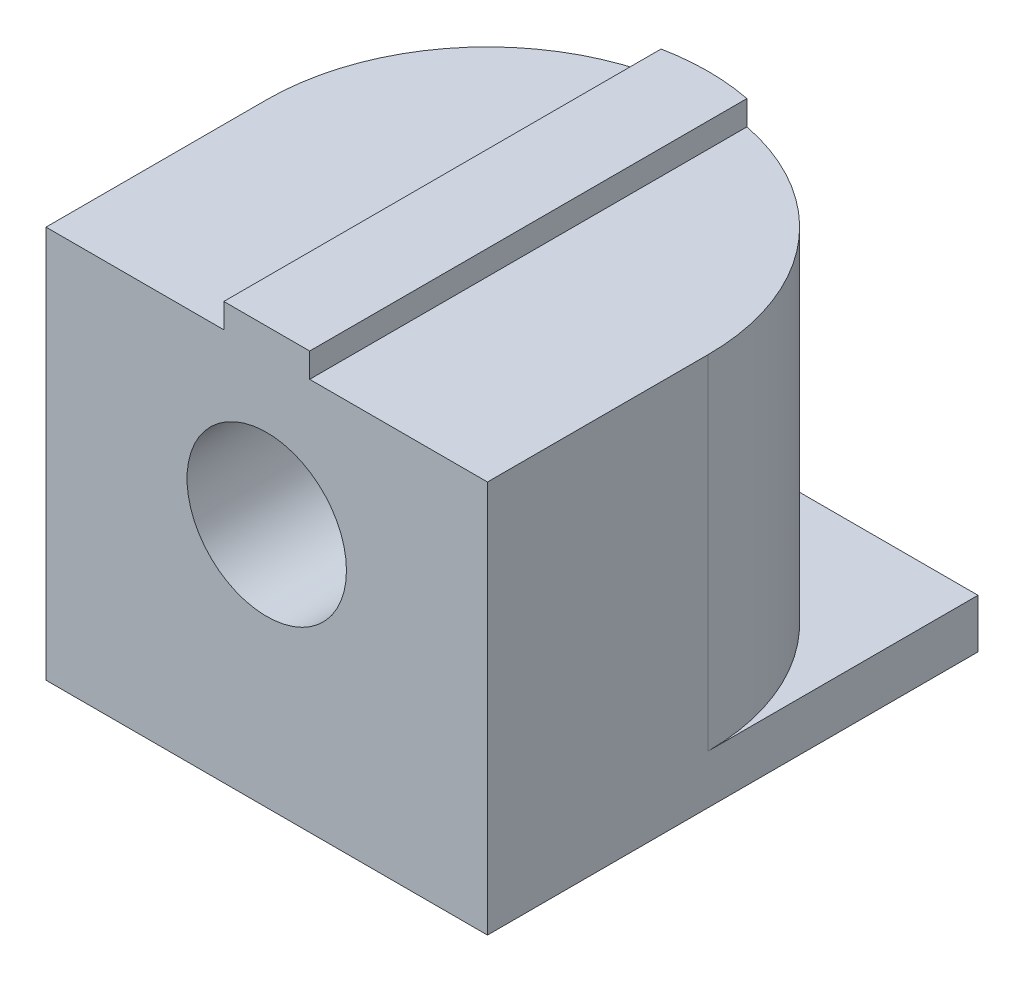
ISO-10303-21;
HEADER;
FILE_DESCRIPTION(('STEP AP214'),'2;1');
FILE_NAME('part.step','',(''),(''),'','','');
FILE_SCHEMA(('AUTOMOTIVE_DESIGN { 1 0 10303 214 1 1 1 1 }'));
ENDSEC;
DATA;
#1=APPLICATION_CONTEXT('core data for automotive mechanical design processes');
#2=APPLICATION_PROTOCOL_DEFINITION('international standard','automotive_design',2000,#1);
#3=PRODUCT_CONTEXT('',#1,'mechanical');
#4=PRODUCT('Part','Part','',(#3));
#5=PRODUCT_RELATED_PRODUCT_CATEGORY('part','',(#4));
#6=PRODUCT_DEFINITION_FORMATION('','',#4);
#7=PRODUCT_DEFINITION_CONTEXT('part definition',#1,'design');
#8=PRODUCT_DEFINITION('design','',#6,#7);
#9=PRODUCT_DEFINITION_SHAPE('','',#8);
#10=(LENGTH_UNIT() NAMED_UNIT(*) SI_UNIT(.MILLI.,.METRE.));
#11=(NAMED_UNIT(*) PLANE_ANGLE_UNIT() SI_UNIT($,.RADIAN.));
#12=(NAMED_UNIT(*) SI_UNIT($,.STERADIAN.) SOLID_ANGLE_UNIT());
#13=UNCERTAINTY_MEASURE_WITH_UNIT(LENGTH_MEASURE(1.E-05),#10,'distance_accuracy_value','');
#14=(GEOMETRIC_REPRESENTATION_CONTEXT(3) GLOBAL_UNCERTAINTY_ASSIGNED_CONTEXT((#13)) GLOBAL_UNIT_ASSIGNED_CONTEXT((#10,
#11,#12)) REPRESENTATION_CONTEXT('',''));
#15=CARTESIAN_POINT('',(0.,0.,0.));
#16=DIRECTION('',(0.,0.,1.));
#17=DIRECTION('',(1.,0.,0.));
#18=AXIS2_PLACEMENT_3D('',#15,#16,#17);
#19=CARTESIAN_POINT('',(0.,8.,0.));
#20=DIRECTION('',(0.,-1.,0.));
#21=DIRECTION('',(0.,0.,-1.));
#22=AXIS2_PLACEMENT_3D('',#19,#20,#21);
#23=PLANE('',#22);
#24=DIRECTION('',(0.,0.,-1.));
#25=VECTOR('',#24,1.);
#26=CARTESIAN_POINT('',(0.874999999999999,8.,-3.91411089575239));
#27=LINE('',#26,#25);
#28=CARTESIAN_POINT('',(0.875,8.,5.));
#29=VERTEX_POINT('',#28);
#30=CARTESIAN_POINT('',(0.874999999999999,8.,-3.91411089575239));
#31=VERTEX_POINT('',#30);
#32=EDGE_CURVE('E50',#29,#31,#27,.T.);
#33=ORIENTED_EDGE('',*,*,#32,.F.);
#34=DIRECTION('',(1.,0.,0.));
#35=VECTOR('',#34,1.);
#36=CARTESIAN_POINT('',(-4.5,8.,5.));
#37=LINE('',#36,#35);
#38=CARTESIAN_POINT('',(4.5,8.,5.));
#39=VERTEX_POINT('',#38);
#40=EDGE_CURVE('E156',#29,#39,#37,.T.);
#41=ORIENTED_EDGE('',*,*,#40,.T.);
#42=DIRECTION('',(0.,0.,-1.));
#43=VECTOR('',#42,1.);
#44=CARTESIAN_POINT('',(4.5,8.,5.));
#45=LINE('',#44,#43);
#46=CARTESIAN_POINT('',(4.5,8.,0.5));
#47=VERTEX_POINT('',#46);
#48=EDGE_CURVE('E159',#39,#47,#45,.T.);
#49=ORIENTED_EDGE('',*,*,#48,.T.);
#50=CARTESIAN_POINT('',(0.,8.,0.5));
#51=DIRECTION('',(0.,-1.,0.));
#52=DIRECTION('',(0.,0.,-1.));
#53=AXIS2_PLACEMENT_3D('',#50,#51,#52);
#54=CIRCLE('',#53,4.5);
#55=EDGE_CURVE('E192',#47,#31,#54,.F.);
#56=ORIENTED_EDGE('',*,*,#55,.T.);
#57=EDGE_LOOP('',(#33,#41,#49,#56));
#58=FACE_BOUND('',#57,.T.);
#59=ADVANCED_FACE('F34',(#58),#23,.F.);
#60=DIRECTION('',(0.,0.,1.));
#61=VECTOR('',#60,1.);
#62=CARTESIAN_POINT('',(-0.875,8.,-3.91411089575239));
#63=LINE('',#62,#61);
#64=CARTESIAN_POINT('',(-0.875,8.,-3.91411089575239));
#65=VERTEX_POINT('',#64);
#66=CARTESIAN_POINT('',(-0.874999999999999,8.,5.));
#67=VERTEX_POINT('',#66);
#68=EDGE_CURVE('E58',#65,#67,#63,.T.);
#69=ORIENTED_EDGE('',*,*,#68,.F.);
#70=CARTESIAN_POINT('',(0.,8.,0.5));
#71=DIRECTION('',(0.,-1.,0.));
#72=DIRECTION('',(0.,0.,-1.));
#73=AXIS2_PLACEMENT_3D('',#70,#71,#72);
#74=CIRCLE('',#73,4.5);
#75=CARTESIAN_POINT('',(-4.5,8.,0.5));
#76=VERTEX_POINT('',#75);
#77=EDGE_CURVE('E132',#65,#76,#74,.F.);
#78=ORIENTED_EDGE('',*,*,#77,.T.);
#79=DIRECTION('',(0.,0.,1.));
#80=VECTOR('',#79,1.);
#81=CARTESIAN_POINT('',(-4.5,8.,5.));
#82=LINE('',#81,#80);
#83=CARTESIAN_POINT('',(-4.5,8.,5.));
#84=VERTEX_POINT('',#83);
#85=EDGE_CURVE('E154',#76,#84,#82,.T.);
#86=ORIENTED_EDGE('',*,*,#85,.T.);
#87=EDGE_CURVE('E157',#84,#67,#37,.T.);
#88=ORIENTED_EDGE('',*,*,#87,.T.);
#89=EDGE_LOOP('',(#69,#78,#86,#88));
#90=FACE_BOUND('',#89,.T.);
#91=ADVANCED_FACE('F227',(#90),#23,.F.);
#92=CARTESIAN_POINT('',(0.,1.,0.));
#93=DIRECTION('',(0.,-1.,0.));
#94=DIRECTION('',(0.,0.,-1.));
#95=AXIS2_PLACEMENT_3D('',#92,#93,#94);
#96=PLANE('',#95);
#97=CARTESIAN_POINT('',(0.,1.,0.5));
#98=DIRECTION('',(0.,-1.,0.));
#99=DIRECTION('',(0.,0.,-1.));
#100=AXIS2_PLACEMENT_3D('',#97,#98,#99);
#101=CIRCLE('',#100,4.5);
#102=CARTESIAN_POINT('',(-4.5,1.,0.5));
#103=VERTEX_POINT('',#102);
#104=CARTESIAN_POINT('',(0.,1.,-4.));
#105=VERTEX_POINT('',#104);
#106=EDGE_CURVE('E43',#103,#105,#101,.T.);
#107=ORIENTED_EDGE('',*,*,#106,.T.);
#108=CARTESIAN_POINT('',(0.,1.,0.5));
#109=DIRECTION('',(0.,-1.,0.));
#110=DIRECTION('',(0.,0.,-1.));
#111=AXIS2_PLACEMENT_3D('',#108,#109,#110);
#112=CIRCLE('',#111,4.5);
#113=CARTESIAN_POINT('',(4.5,1.,0.5));
#114=VERTEX_POINT('',#113);
#115=EDGE_CURVE('E11',#105,#114,#112,.T.);
#116=ORIENTED_EDGE('',*,*,#115,.T.);
#117=DIRECTION('',(0.,0.,-1.));
#118=VECTOR('',#117,1.);
#119=CARTESIAN_POINT('',(4.5,1.,5.));
#120=LINE('',#119,#118);
#121=CARTESIAN_POINT('',(4.5,1.,-5.));
#122=VERTEX_POINT('',#121);
#123=EDGE_CURVE('E165',#114,#122,#120,.T.);
#124=ORIENTED_EDGE('',*,*,#123,.T.);
#125=DIRECTION('',(-1.,0.,0.));
#126=VECTOR('',#125,1.);
#127=CARTESIAN_POINT('',(-4.5,1.,-5.));
#128=LINE('',#127,#126);
#129=CARTESIAN_POINT('',(-4.5,1.,-5.));
#130=VERTEX_POINT('',#129);
#131=EDGE_CURVE('E168',#122,#130,#128,.T.);
#132=ORIENTED_EDGE('',*,*,#131,.T.);
#133=DIRECTION('',(0.,0.,1.));
#134=VECTOR('',#133,1.);
#135=CARTESIAN_POINT('',(-4.5,1.,5.));
#136=LINE('',#135,#134);
#137=EDGE_CURVE('E163',#130,#103,#136,.T.);
#138=ORIENTED_EDGE('',*,*,#137,.T.);
#139=EDGE_LOOP('',(#107,#116,#124,#132,#138));
#140=FACE_BOUND('',#139,.T.);
#141=ADVANCED_FACE('F200',(#140),#96,.F.);
#142=CARTESIAN_POINT('',(-4.5,1.,5.));
#143=DIRECTION('',(1.,0.,0.));
#144=DIRECTION('',(0.,0.,-1.));
#145=AXIS2_PLACEMENT_3D('',#142,#143,#144);
#146=PLANE('',#145);
#147=ORIENTED_EDGE('',*,*,#85,.F.);
#148=DIRECTION('',(0.,-1.,0.));
#149=VECTOR('',#148,1.);
#150=CARTESIAN_POINT('',(-4.5,1.,0.5));
#151=LINE('',#150,#149);
#152=EDGE_CURVE('E189',#76,#103,#151,.T.);
#153=ORIENTED_EDGE('',*,*,#152,.T.);
#154=ORIENTED_EDGE('',*,*,#137,.F.);
#155=DIRECTION('',(0.,-1.,0.));
#156=VECTOR('',#155,1.);
#157=CARTESIAN_POINT('',(-4.5,1.,-5.));
#158=LINE('',#157,#156);
#159=CARTESIAN_POINT('',(-4.5,0.,-5.));
#160=VERTEX_POINT('',#159);
#161=EDGE_CURVE('E170',#130,#160,#158,.T.);
#162=ORIENTED_EDGE('',*,*,#161,.T.);
#163=DIRECTION('',(0.,0.,1.));
#164=VECTOR('',#163,1.);
#165=CARTESIAN_POINT('',(-4.5,0.,5.));
#166=LINE('',#165,#164);
#167=CARTESIAN_POINT('',(-4.5,0.,5.));
#168=VERTEX_POINT('',#167);
#169=EDGE_CURVE('E162',#160,#168,#166,.T.);
#170=ORIENTED_EDGE('',*,*,#169,.T.);
#171=DIRECTION('',(0.,-1.,0.));
#172=VECTOR('',#171,1.);
#173=CARTESIAN_POINT('',(-4.5,1.,5.));
#174=LINE('',#173,#172);
#175=EDGE_CURVE('E186',#84,#168,#174,.T.);
#176=ORIENTED_EDGE('',*,*,#175,.F.);
#177=EDGE_LOOP('',(#147,#153,#154,#162,#170,#176));
#178=FACE_BOUND('',#177,.T.);
#179=ADVANCED_FACE('F224',(#178),#146,.F.);
#180=CARTESIAN_POINT('',(-4.5,1.,5.));
#181=DIRECTION('',(0.,0.,-1.));
#182=DIRECTION('',(-1.,0.,0.));
#183=AXIS2_PLACEMENT_3D('',#180,#181,#182);
#184=PLANE('',#183);
#185=CARTESIAN_POINT('',(0.,5.,5.));
#186=DIRECTION('',(0.,0.,1.));
#187=DIRECTION('',(1.,0.,0.));
#188=AXIS2_PLACEMENT_3D('',#185,#186,#187);
#189=CIRCLE('',#188,1.625);
#190=CARTESIAN_POINT('',(1.625,5.,5.));
#191=VERTEX_POINT('',#190);
#192=EDGE_CURVE('E321',#191,#191,#189,.T.);
#193=ORIENTED_EDGE('',*,*,#192,.F.);
#194=EDGE_LOOP('',(#193));
#195=FACE_BOUND('',#194,.T.);
#196=DIRECTION('',(1.,0.,0.));
#197=VECTOR('',#196,1.);
#198=CARTESIAN_POINT('',(-4.5,0.,5.));
#199=LINE('',#198,#197);
#200=CARTESIAN_POINT('',(4.5,0.,5.));
#201=VERTEX_POINT('',#200);
#202=EDGE_CURVE('E173',#168,#201,#199,.T.);
#203=ORIENTED_EDGE('',*,*,#202,.T.);
#204=DIRECTION('',(0.,-1.,0.));
#205=VECTOR('',#204,1.);
#206=CARTESIAN_POINT('',(4.5,1.,5.));
#207=LINE('',#206,#205);
#208=EDGE_CURVE('E183',#39,#201,#207,.T.);
#209=ORIENTED_EDGE('',*,*,#208,.F.);
#210=ORIENTED_EDGE('',*,*,#40,.F.);
#211=DIRECTION('',(0.,-1.,0.));
#212=VECTOR('',#211,1.);
#213=CARTESIAN_POINT('',(0.875000000000001,8.5,5.));
#214=LINE('',#213,#212);
#215=CARTESIAN_POINT('',(0.875000000000001,8.5,5.));
#216=VERTEX_POINT('',#215);
#217=EDGE_CURVE('E150',#216,#29,#214,.T.);
#218=ORIENTED_EDGE('',*,*,#217,.F.);
#219=DIRECTION('',(1.,0.,0.));
#220=VECTOR('',#219,1.);
#221=CARTESIAN_POINT('',(-0.874999999999999,8.5,5.));
#222=LINE('',#221,#220);
#223=CARTESIAN_POINT('',(-0.874999999999999,8.5,5.));
#224=VERTEX_POINT('',#223);
#225=EDGE_CURVE('E139',#224,#216,#222,.T.);
#226=ORIENTED_EDGE('',*,*,#225,.F.);
#227=DIRECTION('',(0.,-1.,0.));
#228=VECTOR('',#227,1.);
#229=CARTESIAN_POINT('',(-0.874999999999999,8.5,5.));
#230=LINE('',#229,#228);
#231=EDGE_CURVE('E134',#224,#67,#230,.T.);
#232=ORIENTED_EDGE('',*,*,#231,.T.);
#233=ORIENTED_EDGE('',*,*,#87,.F.);
#234=ORIENTED_EDGE('',*,*,#175,.T.);
#235=EDGE_LOOP('',(#203,#209,#210,#218,#226,#232,#233,#234));
#236=FACE_BOUND('',#235,.T.);
#237=ADVANCED_FACE('F212',(#195,#236),#184,.F.);
#238=CARTESIAN_POINT('',(4.5,1.,5.));
#239=DIRECTION('',(-1.,0.,0.));
#240=DIRECTION('',(0.,0.,1.));
#241=AXIS2_PLACEMENT_3D('',#238,#239,#240);
#242=PLANE('',#241);
#243=ORIENTED_EDGE('',*,*,#123,.F.);
#244=DIRECTION('',(0.,-1.,0.));
#245=VECTOR('',#244,1.);
#246=CARTESIAN_POINT('',(4.5,1.,0.5));
#247=LINE('',#246,#245);
#248=EDGE_CURVE('E195',#114,#47,#247,.F.);
#249=ORIENTED_EDGE('',*,*,#248,.T.);
#250=ORIENTED_EDGE('',*,*,#48,.F.);
#251=ORIENTED_EDGE('',*,*,#208,.T.);
#252=DIRECTION('',(0.,0.,-1.));
#253=VECTOR('',#252,1.);
#254=CARTESIAN_POINT('',(4.5,0.,5.));
#255=LINE('',#254,#253);
#256=CARTESIAN_POINT('',(4.5,0.,-5.));
#257=VERTEX_POINT('',#256);
#258=EDGE_CURVE('E175',#201,#257,#255,.T.);
#259=ORIENTED_EDGE('',*,*,#258,.T.);
#260=DIRECTION('',(0.,-1.,0.));
#261=VECTOR('',#260,1.);
#262=CARTESIAN_POINT('',(4.5,1.,-5.));
#263=LINE('',#262,#261);
#264=EDGE_CURVE('E180',#122,#257,#263,.T.);
#265=ORIENTED_EDGE('',*,*,#264,.F.);
#266=EDGE_LOOP('',(#243,#249,#250,#251,#259,#265));
#267=FACE_BOUND('',#266,.T.);
#268=ADVANCED_FACE('F207',(#267),#242,.F.);
#269=CARTESIAN_POINT('',(-4.5,1.,-5.));
#270=DIRECTION('',(0.,0.,1.));
#271=DIRECTION('',(1.,0.,0.));
#272=AXIS2_PLACEMENT_3D('',#269,#270,#271);
#273=PLANE('',#272);
#274=DIRECTION('',(-1.,0.,0.));
#275=VECTOR('',#274,1.);
#276=CARTESIAN_POINT('',(-4.5,0.,-5.));
#277=LINE('',#276,#275);
#278=EDGE_CURVE('E166',#257,#160,#277,.T.);
#279=ORIENTED_EDGE('',*,*,#278,.T.);
#280=ORIENTED_EDGE('',*,*,#161,.F.);
#281=ORIENTED_EDGE('',*,*,#131,.F.);
#282=ORIENTED_EDGE('',*,*,#264,.T.);
#283=EDGE_LOOP('',(#279,#280,#281,#282));
#284=FACE_BOUND('',#283,.T.);
#285=ADVANCED_FACE('F220',(#284),#273,.F.);
#286=CARTESIAN_POINT('',(0.,0.,0.));
#287=DIRECTION('',(0.,-1.,0.));
#288=DIRECTION('',(0.,0.,-1.));
#289=AXIS2_PLACEMENT_3D('',#286,#287,#288);
#290=PLANE('',#289);
#291=ORIENTED_EDGE('',*,*,#169,.F.);
#292=ORIENTED_EDGE('',*,*,#278,.F.);
#293=ORIENTED_EDGE('',*,*,#258,.F.);
#294=ORIENTED_EDGE('',*,*,#202,.F.);
#295=EDGE_LOOP('',(#291,#292,#293,#294));
#296=FACE_BOUND('',#295,.T.);
#297=ADVANCED_FACE('F217',(#296),#290,.T.);
#298=CARTESIAN_POINT('',(0.,8.,0.5));
#299=DIRECTION('',(0.,-1.,0.));
#300=DIRECTION('',(0.,0.,-1.));
#301=AXIS2_PLACEMENT_3D('',#298,#299,#300);
#302=CYLINDRICAL_SURFACE('',#301,4.5);
#303=DIRECTION('',(0.,-1.,0.));
#304=VECTOR('',#303,1.);
#305=CARTESIAN_POINT('',(0.,8.,-4.));
#306=LINE('',#305,#304);
#307=CARTESIAN_POINT('',(0.,8.,-4.));
#308=VERTEX_POINT('',#307);
#309=EDGE_CURVE('E38',#308,#105,#306,.T.);
#310=ORIENTED_EDGE('',*,*,#309,.F.);
#311=ORIENTED_EDGE('',*,*,#309,.T.);
#312=ORIENTED_EDGE('',*,*,#106,.F.);
#313=ORIENTED_EDGE('',*,*,#152,.F.);
#314=ORIENTED_EDGE('',*,*,#77,.F.);
#315=DIRECTION('',(0.,-1.,0.));
#316=VECTOR('',#315,1.);
#317=CARTESIAN_POINT('',(-0.874999999999999,8.5,-3.91411089575239));
#318=LINE('',#317,#316);
#319=CARTESIAN_POINT('',(-0.874999999999999,8.5,-3.91411089575239));
#320=VERTEX_POINT('',#319);
#321=EDGE_CURVE('E130',#320,#65,#318,.T.);
#322=ORIENTED_EDGE('',*,*,#321,.F.);
#323=CARTESIAN_POINT('',(0.,8.5,0.5));
#324=DIRECTION('',(0.,1.,0.));
#325=DIRECTION('',(0.,0.,1.));
#326=AXIS2_PLACEMENT_3D('',#323,#324,#325);
#327=CIRCLE('',#326,4.5);
#328=CARTESIAN_POINT('',(0.874999999999999,8.5,-3.91411089575239));
#329=VERTEX_POINT('',#328);
#330=EDGE_CURVE('E117',#329,#320,#327,.T.);
#331=ORIENTED_EDGE('',*,*,#330,.F.);
#332=DIRECTION('',(0.,-1.,0.));
#333=VECTOR('',#332,1.);
#334=CARTESIAN_POINT('',(0.874999999999999,8.5,-3.91411089575239));
#335=LINE('',#334,#333);
#336=EDGE_CURVE('E145',#329,#31,#335,.T.);
#337=ORIENTED_EDGE('',*,*,#336,.T.);
#338=ORIENTED_EDGE('',*,*,#55,.F.);
#339=ORIENTED_EDGE('',*,*,#248,.F.);
#340=ORIENTED_EDGE('',*,*,#115,.F.);
#341=EDGE_LOOP('',(#310,#311,#312,#313,#314,#322,#331,#337,#338,#339,#340));
#342=FACE_BOUND('',#341,.T.);
#343=ADVANCED_FACE('F36',(#342),#302,.T.);
#344=CARTESIAN_POINT('',(-0.875,8.5,-3.91411089575239));
#345=DIRECTION('',(1.,0.,0.));
#346=DIRECTION('',(0.,0.,-1.));
#347=AXIS2_PLACEMENT_3D('',#344,#345,#346);
#348=PLANE('',#347);
#349=ORIENTED_EDGE('',*,*,#68,.T.);
#350=ORIENTED_EDGE('',*,*,#231,.F.);
#351=DIRECTION('',(0.,0.,1.));
#352=VECTOR('',#351,1.);
#353=CARTESIAN_POINT('',(-0.875,8.5,-3.91411089575239));
#354=LINE('',#353,#352);
#355=EDGE_CURVE('E121',#320,#224,#354,.T.);
#356=ORIENTED_EDGE('',*,*,#355,.F.);
#357=ORIENTED_EDGE('',*,*,#321,.T.);
#358=EDGE_LOOP('',(#349,#350,#356,#357));
#359=FACE_BOUND('',#358,.T.);
#360=ADVANCED_FACE('F136',(#359),#348,.F.);
#361=CARTESIAN_POINT('',(0.874999999999999,8.5,-3.91411089575239));
#362=DIRECTION('',(-1.,0.,0.));
#363=DIRECTION('',(0.,0.,1.));
#364=AXIS2_PLACEMENT_3D('',#361,#362,#363);
#365=PLANE('',#364);
#366=ORIENTED_EDGE('',*,*,#32,.T.);
#367=ORIENTED_EDGE('',*,*,#336,.F.);
#368=DIRECTION('',(0.,0.,-1.));
#369=VECTOR('',#368,1.);
#370=CARTESIAN_POINT('',(0.874999999999999,8.5,-3.91411089575239));
#371=LINE('',#370,#369);
#372=EDGE_CURVE('E124',#216,#329,#371,.T.);
#373=ORIENTED_EDGE('',*,*,#372,.F.);
#374=ORIENTED_EDGE('',*,*,#217,.T.);
#375=EDGE_LOOP('',(#366,#367,#373,#374));
#376=FACE_BOUND('',#375,.T.);
#377=ADVANCED_FACE('F229',(#376),#365,.F.);
#378=CARTESIAN_POINT('',(0.,8.5,0.5));
#379=DIRECTION('',(0.,1.,0.));
#380=DIRECTION('',(0.,0.,1.));
#381=AXIS2_PLACEMENT_3D('',#378,#379,#380);
#382=PLANE('',#381);
#383=ORIENTED_EDGE('',*,*,#330,.T.);
#384=ORIENTED_EDGE('',*,*,#355,.T.);
#385=ORIENTED_EDGE('',*,*,#225,.T.);
#386=ORIENTED_EDGE('',*,*,#372,.T.);
#387=EDGE_LOOP('',(#383,#384,#385,#386));
#388=FACE_BOUND('',#387,.T.);
#389=ADVANCED_FACE('F119',(#388),#382,.T.);
#390=CARTESIAN_POINT('',(0.,5.,-0.999999999999998));
#391=DIRECTION('',(0.,0.,1.));
#392=DIRECTION('',(1.,0.,0.));
#393=AXIS2_PLACEMENT_3D('',#390,#391,#392);
#394=CYLINDRICAL_SURFACE('',#393,1.625);
#395=CARTESIAN_POINT('',(0.,5.,-0.999999999999998));
#396=DIRECTION('',(0.,0.,1.));
#397=DIRECTION('',(1.,0.,0.));
#398=AXIS2_PLACEMENT_3D('',#395,#396,#397);
#399=CIRCLE('',#398,1.625);
#400=CARTESIAN_POINT('',(1.625,5.,-0.999999999999998));
#401=VERTEX_POINT('',#400);
#402=EDGE_CURVE('E147',#401,#401,#399,.T.);
#403=ORIENTED_EDGE('',*,*,#402,.F.);
#404=EDGE_LOOP('',(#403));
#405=FACE_BOUND('',#404,.T.);
#406=ORIENTED_EDGE('',*,*,#192,.T.);
#407=EDGE_LOOP('',(#406));
#408=FACE_BOUND('',#407,.T.);
#409=ADVANCED_FACE('F236',(#405,#408),#394,.F.);
#410=CARTESIAN_POINT('',(0.,5.,-0.999999999999998));
#411=DIRECTION('',(0.,0.,1.));
#412=DIRECTION('',(1.,0.,0.));
#413=AXIS2_PLACEMENT_3D('',#410,#411,#412);
#414=PLANE('',#413);
#415=ORIENTED_EDGE('',*,*,#402,.T.);
#416=EDGE_LOOP('',(#415));
#417=FACE_BOUND('',#416,.T.);
#418=ADVANCED_FACE('F305',(#417),#414,.T.);
#419=CLOSED_SHELL('',(#59,#91,#141,#179,#237,#268,#285,#297,#343,#360,#377,#389,#409,#418));
#420=MANIFOLD_SOLID_BREP('B2',#419);
#421=ADVANCED_BREP_SHAPE_REPRESENTATION('',(#18,#420),#14);
#422=SHAPE_DEFINITION_REPRESENTATION(#9,#421);
ENDSEC;
END-ISO-10303-21;
